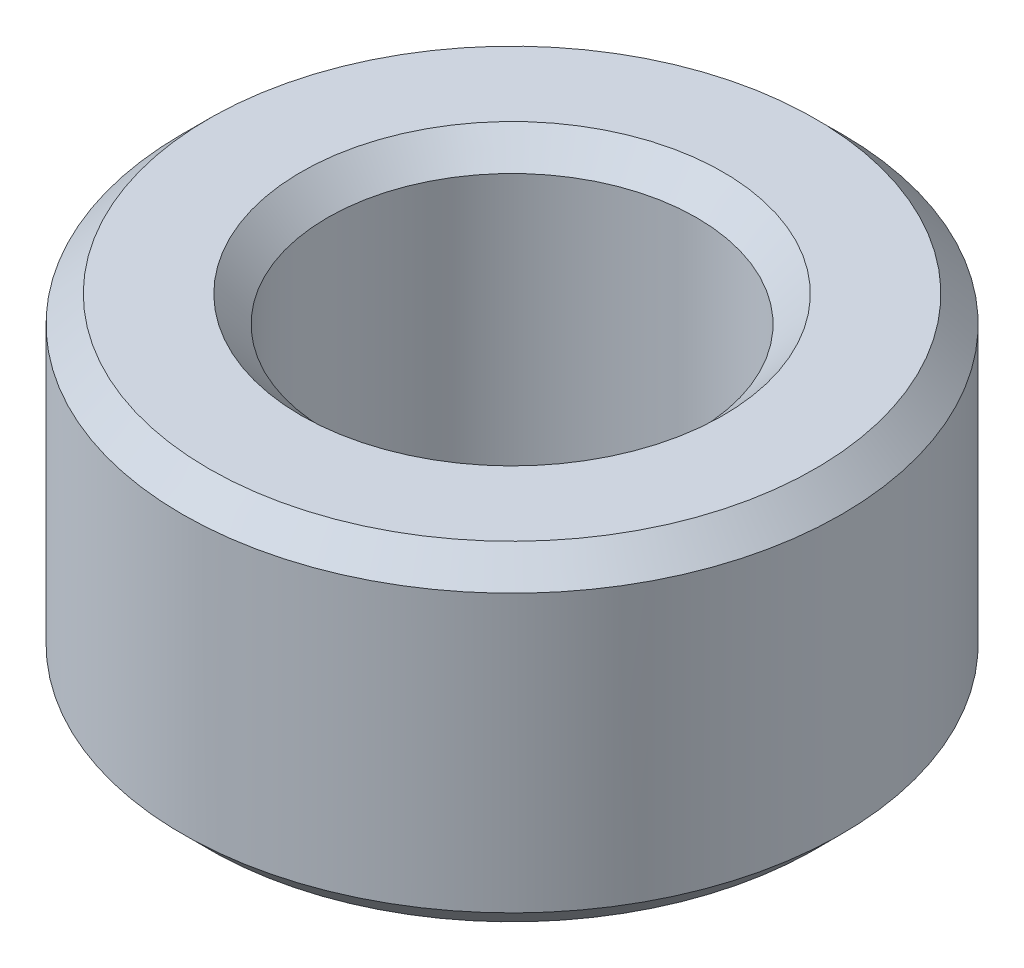
ISO-10303-21;
HEADER;
FILE_DESCRIPTION(('STEP AP214'),'2;1');
FILE_NAME('part.step','',(''),(''),'','','');
FILE_SCHEMA(('AUTOMOTIVE_DESIGN { 1 0 10303 214 1 1 1 1 }'));
ENDSEC;
DATA;
#1=APPLICATION_CONTEXT('core data for automotive mechanical design processes');
#2=APPLICATION_PROTOCOL_DEFINITION('international standard','automotive_design',2000,#1);
#3=PRODUCT_CONTEXT('',#1,'mechanical');
#4=PRODUCT('Part','Part','',(#3));
#5=PRODUCT_RELATED_PRODUCT_CATEGORY('part','',(#4));
#6=PRODUCT_DEFINITION_FORMATION('','',#4);
#7=PRODUCT_DEFINITION_CONTEXT('part definition',#1,'design');
#8=PRODUCT_DEFINITION('design','',#6,#7);
#9=PRODUCT_DEFINITION_SHAPE('','',#8);
#10=(LENGTH_UNIT() NAMED_UNIT(*) SI_UNIT(.MILLI.,.METRE.));
#11=(NAMED_UNIT(*) PLANE_ANGLE_UNIT() SI_UNIT($,.RADIAN.));
#12=(NAMED_UNIT(*) SI_UNIT($,.STERADIAN.) SOLID_ANGLE_UNIT());
#13=UNCERTAINTY_MEASURE_WITH_UNIT(LENGTH_MEASURE(1.E-05),#10,'distance_accuracy_value','');
#14=(GEOMETRIC_REPRESENTATION_CONTEXT(3) GLOBAL_UNCERTAINTY_ASSIGNED_CONTEXT((#13)) GLOBAL_UNIT_ASSIGNED_CONTEXT((#10,
#11,#12)) REPRESENTATION_CONTEXT('',''));
#15=CARTESIAN_POINT('',(0.,0.,0.));
#16=DIRECTION('',(0.,0.,1.));
#17=DIRECTION('',(1.,0.,0.));
#18=AXIS2_PLACEMENT_3D('',#15,#16,#17);
#19=CARTESIAN_POINT('',(0.,0.,0.));
#20=DIRECTION('',(0.,-1.,0.));
#21=DIRECTION('',(0.,0.,-1.));
#22=AXIS2_PLACEMENT_3D('',#19,#20,#21);
#23=CYLINDRICAL_SURFACE('',#22,1.778);
#24=CARTESIAN_POINT('',(0.,1.3335,0.));
#25=DIRECTION('',(0.,1.,0.));
#26=DIRECTION('',(0.,0.,1.));
#27=AXIS2_PLACEMENT_3D('',#24,#25,#26);
#28=CIRCLE('',#27,1.778);
#29=CARTESIAN_POINT('',(0.,1.3335,1.778));
#30=VERTEX_POINT('',#29);
#31=EDGE_CURVE('E10',#30,#30,#28,.T.);
#32=ORIENTED_EDGE('',*,*,#31,.T.);
#33=EDGE_LOOP('',(#32));
#34=FACE_BOUND('',#33,.T.);
#35=CARTESIAN_POINT('',(0.,-1.3335,0.));
#36=DIRECTION('',(0.,-1.,0.));
#37=DIRECTION('',(0.,0.,-1.));
#38=AXIS2_PLACEMENT_3D('',#35,#36,#37);
#39=CIRCLE('',#38,1.778);
#40=CARTESIAN_POINT('',(0.,-1.3335,-1.778));
#41=VERTEX_POINT('',#40);
#42=EDGE_CURVE('E37',#41,#41,#39,.T.);
#43=ORIENTED_EDGE('',*,*,#42,.T.);
#44=EDGE_LOOP('',(#43));
#45=FACE_BOUND('',#44,.T.);
#46=ADVANCED_FACE('F30',(#34,#45),#23,.F.);
#47=CARTESIAN_POINT('',(1.778,1.5875,0.));
#48=DIRECTION('',(0.,1.,0.));
#49=DIRECTION('',(0.,0.,1.));
#50=AXIS2_PLACEMENT_3D('',#47,#48,#49);
#51=PLANE('',#50);
#52=CARTESIAN_POINT('',(0.,1.5875,0.));
#53=DIRECTION('',(0.,1.,0.));
#54=DIRECTION('',(0.,0.,1.));
#55=AXIS2_PLACEMENT_3D('',#52,#53,#54);
#56=CIRCLE('',#55,2.921);
#57=CARTESIAN_POINT('',(0.,1.5875,2.921));
#58=VERTEX_POINT('',#57);
#59=EDGE_CURVE('E41',#58,#58,#56,.T.);
#60=ORIENTED_EDGE('',*,*,#59,.T.);
#61=EDGE_LOOP('',(#60));
#62=FACE_BOUND('',#61,.T.);
#63=CARTESIAN_POINT('',(0.,1.5875,0.));
#64=DIRECTION('',(0.,1.,0.));
#65=DIRECTION('',(0.,0.,1.));
#66=AXIS2_PLACEMENT_3D('',#63,#64,#65);
#67=CIRCLE('',#66,2.032);
#68=CARTESIAN_POINT('',(0.,1.5875,2.032));
#69=VERTEX_POINT('',#68);
#70=EDGE_CURVE('E45',#69,#69,#67,.F.);
#71=ORIENTED_EDGE('',*,*,#70,.T.);
#72=EDGE_LOOP('',(#71));
#73=FACE_BOUND('',#72,.T.);
#74=ADVANCED_FACE('F74',(#62,#73),#51,.T.);
#75=CARTESIAN_POINT('',(0.,0.,0.));
#76=DIRECTION('',(0.,-1.,0.));
#77=DIRECTION('',(0.,0.,-1.));
#78=AXIS2_PLACEMENT_3D('',#75,#76,#77);
#79=CYLINDRICAL_SURFACE('',#78,3.175);
#80=CARTESIAN_POINT('',(0.,-1.3335,0.));
#81=DIRECTION('',(0.,-1.,0.));
#82=DIRECTION('',(0.,0.,-1.));
#83=AXIS2_PLACEMENT_3D('',#80,#81,#82);
#84=CIRCLE('',#83,3.175);
#85=CARTESIAN_POINT('',(0.,-1.3335,-3.175));
#86=VERTEX_POINT('',#85);
#87=EDGE_CURVE('E50',#86,#86,#84,.F.);
#88=ORIENTED_EDGE('',*,*,#87,.T.);
#89=EDGE_LOOP('',(#88));
#90=FACE_BOUND('',#89,.T.);
#91=CARTESIAN_POINT('',(0.,1.3335,0.));
#92=DIRECTION('',(0.,1.,0.));
#93=DIRECTION('',(0.,0.,1.));
#94=AXIS2_PLACEMENT_3D('',#91,#92,#93);
#95=CIRCLE('',#94,3.175);
#96=CARTESIAN_POINT('',(0.,1.3335,3.175));
#97=VERTEX_POINT('',#96);
#98=EDGE_CURVE('E53',#97,#97,#95,.F.);
#99=ORIENTED_EDGE('',*,*,#98,.T.);
#100=EDGE_LOOP('',(#99));
#101=FACE_BOUND('',#100,.T.);
#102=ADVANCED_FACE('F79',(#90,#101),#79,.T.);
#103=CARTESIAN_POINT('',(3.175,-1.5875,0.));
#104=DIRECTION('',(0.,-1.,0.));
#105=DIRECTION('',(0.,0.,-1.));
#106=AXIS2_PLACEMENT_3D('',#103,#104,#105);
#107=PLANE('',#106);
#108=CARTESIAN_POINT('',(0.,-1.5875,0.));
#109=DIRECTION('',(0.,-1.,0.));
#110=DIRECTION('',(0.,0.,-1.));
#111=AXIS2_PLACEMENT_3D('',#108,#109,#110);
#112=CIRCLE('',#111,2.921);
#113=CARTESIAN_POINT('',(0.,-1.5875,-2.921));
#114=VERTEX_POINT('',#113);
#115=EDGE_CURVE('E56',#114,#114,#112,.T.);
#116=ORIENTED_EDGE('',*,*,#115,.T.);
#117=EDGE_LOOP('',(#116));
#118=FACE_BOUND('',#117,.T.);
#119=CARTESIAN_POINT('',(0.,-1.5875,0.));
#120=DIRECTION('',(0.,-1.,0.));
#121=DIRECTION('',(0.,0.,-1.));
#122=AXIS2_PLACEMENT_3D('',#119,#120,#121);
#123=CIRCLE('',#122,2.032);
#124=CARTESIAN_POINT('',(0.,-1.5875,-2.032));
#125=VERTEX_POINT('',#124);
#126=EDGE_CURVE('E59',#125,#125,#123,.F.);
#127=ORIENTED_EDGE('',*,*,#126,.T.);
#128=EDGE_LOOP('',(#127));
#129=FACE_BOUND('',#128,.T.);
#130=ADVANCED_FACE('F63',(#118,#129),#107,.T.);
#131=CARTESIAN_POINT('',(0.,-1.5875,0.));
#132=DIRECTION('',(0.,1.,0.));
#133=DIRECTION('',(0.,0.,1.));
#134=AXIS2_PLACEMENT_3D('',#131,#132,#133);
#135=CONICAL_SURFACE('',#134,2.921,0.785398163397447);
#136=ORIENTED_EDGE('',*,*,#87,.F.);
#137=EDGE_LOOP('',(#136));
#138=FACE_BOUND('',#137,.T.);
#139=ORIENTED_EDGE('',*,*,#115,.F.);
#140=EDGE_LOOP('',(#139));
#141=FACE_BOUND('',#140,.T.);
#142=ADVANCED_FACE('F84',(#138,#141),#135,.T.);
#143=CARTESIAN_POINT('',(0.,1.3335,0.));
#144=DIRECTION('',(0.,-1.,0.));
#145=DIRECTION('',(0.,0.,-1.));
#146=AXIS2_PLACEMENT_3D('',#143,#144,#145);
#147=CONICAL_SURFACE('',#146,3.175,0.785398163397451);
#148=ORIENTED_EDGE('',*,*,#59,.F.);
#149=EDGE_LOOP('',(#148));
#150=FACE_BOUND('',#149,.T.);
#151=ORIENTED_EDGE('',*,*,#98,.F.);
#152=EDGE_LOOP('',(#151));
#153=FACE_BOUND('',#152,.T.);
#154=ADVANCED_FACE('F71',(#150,#153),#147,.T.);
#155=CARTESIAN_POINT('',(0.,1.5875,0.));
#156=DIRECTION('',(0.,1.,0.));
#157=DIRECTION('',(0.,0.,1.));
#158=AXIS2_PLACEMENT_3D('',#155,#156,#157);
#159=CONICAL_SURFACE('',#158,2.032,0.785398163397447);
#160=ORIENTED_EDGE('',*,*,#31,.F.);
#161=EDGE_LOOP('',(#160));
#162=FACE_BOUND('',#161,.T.);
#163=ORIENTED_EDGE('',*,*,#70,.F.);
#164=EDGE_LOOP('',(#163));
#165=FACE_BOUND('',#164,.T.);
#166=ADVANCED_FACE('F67',(#162,#165),#159,.F.);
#167=CARTESIAN_POINT('',(0.,-1.3335,0.));
#168=DIRECTION('',(0.,-1.,0.));
#169=DIRECTION('',(0.,0.,-1.));
#170=AXIS2_PLACEMENT_3D('',#167,#168,#169);
#171=CONICAL_SURFACE('',#170,1.778,0.78539816339745);
#172=ORIENTED_EDGE('',*,*,#126,.F.);
#173=EDGE_LOOP('',(#172));
#174=FACE_BOUND('',#173,.T.);
#175=ORIENTED_EDGE('',*,*,#42,.F.);
#176=EDGE_LOOP('',(#175));
#177=FACE_BOUND('',#176,.T.);
#178=ADVANCED_FACE('F32',(#174,#177),#171,.F.);
#179=CLOSED_SHELL('',(#46,#74,#102,#130,#142,#154,#166,#178));
#180=MANIFOLD_SOLID_BREP('B2',#179);
#181=ADVANCED_BREP_SHAPE_REPRESENTATION('',(#18,#180),#14);
#182=SHAPE_DEFINITION_REPRESENTATION(#9,#181);
ENDSEC;
END-ISO-10303-21;
